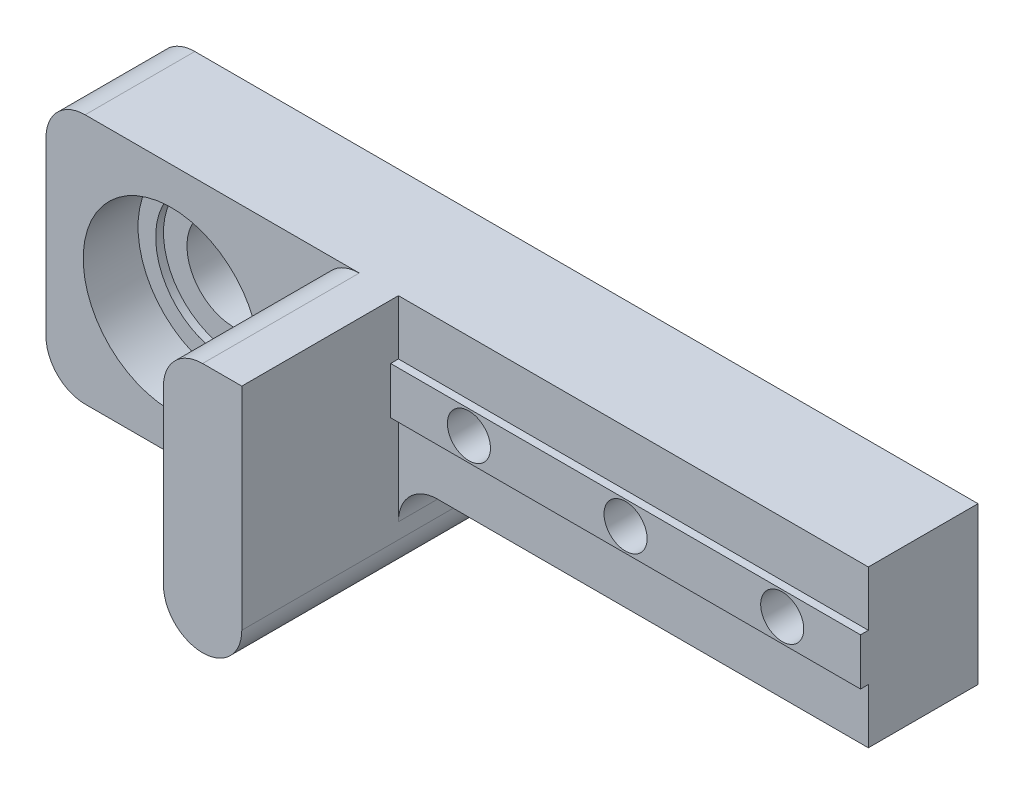
ISO-10303-21;
HEADER;
FILE_DESCRIPTION(('STEP AP214'),'2;1');
FILE_NAME('part.step','',(''),(''),'','','');
FILE_SCHEMA(('AUTOMOTIVE_DESIGN { 1 0 10303 214 1 1 1 1 }'));
ENDSEC;
DATA;
#1=APPLICATION_CONTEXT('core data for automotive mechanical design processes');
#2=APPLICATION_PROTOCOL_DEFINITION('international standard','automotive_design',2000,#1);
#3=PRODUCT_CONTEXT('',#1,'mechanical');
#4=PRODUCT('Part','Part','',(#3));
#5=PRODUCT_RELATED_PRODUCT_CATEGORY('part','',(#4));
#6=PRODUCT_DEFINITION_FORMATION('','',#4);
#7=PRODUCT_DEFINITION_CONTEXT('part definition',#1,'design');
#8=PRODUCT_DEFINITION('design','',#6,#7);
#9=PRODUCT_DEFINITION_SHAPE('','',#8);
#10=(LENGTH_UNIT() NAMED_UNIT(*) SI_UNIT(.MILLI.,.METRE.));
#11=(NAMED_UNIT(*) PLANE_ANGLE_UNIT() SI_UNIT($,.RADIAN.));
#12=(NAMED_UNIT(*) SI_UNIT($,.STERADIAN.) SOLID_ANGLE_UNIT());
#13=UNCERTAINTY_MEASURE_WITH_UNIT(LENGTH_MEASURE(1.E-05),#10,'distance_accuracy_value','');
#14=(GEOMETRIC_REPRESENTATION_CONTEXT(3) GLOBAL_UNCERTAINTY_ASSIGNED_CONTEXT((#13)) GLOBAL_UNIT_ASSIGNED_CONTEXT((#10,
#11,#12)) REPRESENTATION_CONTEXT('',''));
#15=CARTESIAN_POINT('',(0.,0.,0.));
#16=DIRECTION('',(0.,0.,1.));
#17=DIRECTION('',(1.,0.,0.));
#18=AXIS2_PLACEMENT_3D('',#15,#16,#17);
#19=CARTESIAN_POINT('',(-30.,-10.,40.));
#20=DIRECTION('',(0.,0.,-1.));
#21=DIRECTION('',(-1.,0.,0.));
#22=AXIS2_PLACEMENT_3D('',#19,#20,#21);
#23=CYLINDRICAL_SURFACE('',#22,2.75);
#24=CARTESIAN_POINT('',(-30.,-10.,15.));
#25=DIRECTION('',(0.,0.,-1.));
#26=DIRECTION('',(-1.,0.,0.));
#27=AXIS2_PLACEMENT_3D('',#24,#25,#26);
#28=CIRCLE('',#27,2.75);
#29=CARTESIAN_POINT('',(-32.75,-10.,15.));
#30=VERTEX_POINT('',#29);
#31=EDGE_CURVE('E330',#30,#30,#28,.T.);
#32=ORIENTED_EDGE('',*,*,#31,.F.);
#33=EDGE_LOOP('',(#32));
#34=FACE_BOUND('',#33,.T.);
#35=CARTESIAN_POINT('',(-30.,-10.,8.));
#36=DIRECTION('',(0.,0.,-1.));
#37=DIRECTION('',(-1.,0.,0.));
#38=AXIS2_PLACEMENT_3D('',#35,#36,#37);
#39=CIRCLE('',#38,2.75);
#40=CARTESIAN_POINT('',(-32.75,-10.,8.));
#41=VERTEX_POINT('',#40);
#42=EDGE_CURVE('E43',#41,#41,#39,.F.);
#43=ORIENTED_EDGE('',*,*,#42,.F.);
#44=EDGE_LOOP('',(#43));
#45=FACE_BOUND('',#44,.T.);
#46=ADVANCED_FACE('F39',(#34,#45),#23,.F.);
#47=CARTESIAN_POINT('',(-10.,-10.,40.));
#48=DIRECTION('',(0.,0.,-1.));
#49=DIRECTION('',(-1.,0.,0.));
#50=AXIS2_PLACEMENT_3D('',#47,#48,#49);
#51=CYLINDRICAL_SURFACE('',#50,2.75);
#52=CARTESIAN_POINT('',(-10.,-10.,15.));
#53=DIRECTION('',(0.,0.,-1.));
#54=DIRECTION('',(-1.,0.,0.));
#55=AXIS2_PLACEMENT_3D('',#52,#53,#54);
#56=CIRCLE('',#55,2.75);
#57=CARTESIAN_POINT('',(-12.75,-10.,15.));
#58=VERTEX_POINT('',#57);
#59=EDGE_CURVE('E333',#58,#58,#56,.T.);
#60=ORIENTED_EDGE('',*,*,#59,.F.);
#61=EDGE_LOOP('',(#60));
#62=FACE_BOUND('',#61,.T.);
#63=CARTESIAN_POINT('',(-10.,-10.,8.));
#64=DIRECTION('',(0.,0.,-1.));
#65=DIRECTION('',(-1.,0.,0.));
#66=AXIS2_PLACEMENT_3D('',#63,#64,#65);
#67=CIRCLE('',#66,2.75);
#68=CARTESIAN_POINT('',(-12.75,-10.,8.));
#69=VERTEX_POINT('',#68);
#70=EDGE_CURVE('E340',#69,#69,#67,.F.);
#71=ORIENTED_EDGE('',*,*,#70,.F.);
#72=EDGE_LOOP('',(#71));
#73=FACE_BOUND('',#72,.T.);
#74=ADVANCED_FACE('F351',(#62,#73),#51,.F.);
#75=CARTESIAN_POINT('',(-50.,-10.,40.));
#76=DIRECTION('',(0.,0.,-1.));
#77=DIRECTION('',(-1.,0.,0.));
#78=AXIS2_PLACEMENT_3D('',#75,#76,#77);
#79=CYLINDRICAL_SURFACE('',#78,2.75);
#80=CARTESIAN_POINT('',(-50.,-10.,15.));
#81=DIRECTION('',(0.,0.,-1.));
#82=DIRECTION('',(-1.,0.,0.));
#83=AXIS2_PLACEMENT_3D('',#80,#81,#82);
#84=CIRCLE('',#83,2.75);
#85=CARTESIAN_POINT('',(-52.75,-10.,15.));
#86=VERTEX_POINT('',#85);
#87=EDGE_CURVE('E200',#86,#86,#84,.T.);
#88=ORIENTED_EDGE('',*,*,#87,.F.);
#89=EDGE_LOOP('',(#88));
#90=FACE_BOUND('',#89,.T.);
#91=CARTESIAN_POINT('',(-50.,-10.,8.));
#92=DIRECTION('',(0.,0.,-1.));
#93=DIRECTION('',(-1.,0.,0.));
#94=AXIS2_PLACEMENT_3D('',#91,#92,#93);
#95=CIRCLE('',#94,2.75);
#96=CARTESIAN_POINT('',(-52.75,-10.,8.));
#97=VERTEX_POINT('',#96);
#98=EDGE_CURVE('E338',#97,#97,#95,.F.);
#99=ORIENTED_EDGE('',*,*,#98,.F.);
#100=EDGE_LOOP('',(#99));
#101=FACE_BOUND('',#100,.T.);
#102=ADVANCED_FACE('F358',(#90,#101),#79,.F.);
#103=CARTESIAN_POINT('',(0.,0.,14.));
#104=DIRECTION('',(0.,0.,1.));
#105=DIRECTION('',(1.,0.,0.));
#106=AXIS2_PLACEMENT_3D('',#103,#104,#105);
#107=PLANE('',#106);
#108=DIRECTION('',(1.,0.,0.));
#109=VECTOR('',#108,1.);
#110=CARTESIAN_POINT('',(-60.,-7.,14.));
#111=LINE('',#110,#109);
#112=CARTESIAN_POINT('',(-60.,-7.,14.));
#113=VERTEX_POINT('',#112);
#114=CARTESIAN_POINT('',(0.,-7.,14.));
#115=VERTEX_POINT('',#114);
#116=EDGE_CURVE('E191',#113,#115,#111,.T.);
#117=ORIENTED_EDGE('',*,*,#116,.T.);
#118=DIRECTION('',(0.,1.,0.));
#119=VECTOR('',#118,1.);
#120=CARTESIAN_POINT('',(0.,-20.,14.));
#121=LINE('',#120,#119);
#122=CARTESIAN_POINT('',(0.,0.,14.));
#123=VERTEX_POINT('',#122);
#124=EDGE_CURVE('E247',#115,#123,#121,.T.);
#125=ORIENTED_EDGE('',*,*,#124,.T.);
#126=DIRECTION('',(-1.,0.,0.));
#127=VECTOR('',#126,1.);
#128=CARTESIAN_POINT('',(0.,0.,14.));
#129=LINE('',#128,#127);
#130=CARTESIAN_POINT('',(-60.,0.,14.));
#131=VERTEX_POINT('',#130);
#132=EDGE_CURVE('E248',#123,#131,#129,.T.);
#133=ORIENTED_EDGE('',*,*,#132,.T.);
#134=DIRECTION('',(0.,1.,0.));
#135=VECTOR('',#134,1.);
#136=CARTESIAN_POINT('',(-60.,-32.,14.));
#137=LINE('',#136,#135);
#138=EDGE_CURVE('E220',#113,#131,#137,.T.);
#139=ORIENTED_EDGE('',*,*,#138,.F.);
#140=EDGE_LOOP('',(#117,#125,#133,#139));
#141=FACE_BOUND('',#140,.T.);
#142=ADVANCED_FACE('F408',(#141),#107,.T.);
#143=DIRECTION('',(0.,-1.,0.));
#144=VECTOR('',#143,1.);
#145=CARTESIAN_POINT('',(-105.,0.,14.));
#146=LINE('',#145,#144);
#147=CARTESIAN_POINT('',(-105.,-5.00000000000001,14.));
#148=VERTEX_POINT('',#147);
#149=CARTESIAN_POINT('',(-105.,-27.,14.));
#150=VERTEX_POINT('',#149);
#151=EDGE_CURVE('E251',#148,#150,#146,.T.);
#152=ORIENTED_EDGE('',*,*,#151,.T.);
#153=CARTESIAN_POINT('',(-100.,-27.,14.));
#154=DIRECTION('',(0.,0.,1.));
#155=DIRECTION('',(1.,0.,0.));
#156=AXIS2_PLACEMENT_3D('',#153,#154,#155);
#157=CIRCLE('',#156,5.);
#158=CARTESIAN_POINT('',(-100.,-32.,14.));
#159=VERTEX_POINT('',#158);
#160=EDGE_CURVE('E312',#150,#159,#157,.T.);
#161=ORIENTED_EDGE('',*,*,#160,.T.);
#162=DIRECTION('',(1.,0.,0.));
#163=VECTOR('',#162,1.);
#164=CARTESIAN_POINT('',(-105.,-32.,14.));
#165=LINE('',#164,#163);
#166=CARTESIAN_POINT('',(-65.,-32.,14.));
#167=VERTEX_POINT('',#166);
#168=EDGE_CURVE('E254',#159,#167,#165,.T.);
#169=ORIENTED_EDGE('',*,*,#168,.T.);
#170=CARTESIAN_POINT('',(-65.,-27.,14.));
#171=DIRECTION('',(0.,0.,1.));
#172=DIRECTION('',(1.,0.,0.));
#173=AXIS2_PLACEMENT_3D('',#170,#171,#172);
#174=CIRCLE('',#173,5.);
#175=CARTESIAN_POINT('',(-70.,-27.,14.));
#176=VERTEX_POINT('',#175);
#177=EDGE_CURVE('E48',#167,#176,#174,.F.);
#178=ORIENTED_EDGE('',*,*,#177,.T.);
#179=DIRECTION('',(0.,-1.,0.));
#180=VECTOR('',#179,1.);
#181=CARTESIAN_POINT('',(-70.,0.,14.));
#182=LINE('',#181,#180);
#183=CARTESIAN_POINT('',(-70.,-5.00000000000001,14.));
#184=VERTEX_POINT('',#183);
#185=EDGE_CURVE('E210',#184,#176,#182,.T.);
#186=ORIENTED_EDGE('',*,*,#185,.F.);
#187=CARTESIAN_POINT('',(-65.,-5.00000000000001,14.));
#188=DIRECTION('',(0.,0.,1.));
#189=DIRECTION('',(1.,0.,0.));
#190=AXIS2_PLACEMENT_3D('',#187,#188,#189);
#191=CIRCLE('',#190,5.);
#192=CARTESIAN_POINT('',(-65.,0.,14.));
#193=VERTEX_POINT('',#192);
#194=EDGE_CURVE('E11',#184,#193,#191,.F.);
#195=ORIENTED_EDGE('',*,*,#194,.T.);
#196=CARTESIAN_POINT('',(-100.,0.,14.));
#197=VERTEX_POINT('',#196);
#198=EDGE_CURVE('E246',#193,#197,#129,.T.);
#199=ORIENTED_EDGE('',*,*,#198,.T.);
#200=CARTESIAN_POINT('',(-100.,-5.00000000000001,14.));
#201=DIRECTION('',(0.,0.,1.));
#202=DIRECTION('',(1.,0.,0.));
#203=AXIS2_PLACEMENT_3D('',#200,#201,#202);
#204=CIRCLE('',#203,5.);
#205=EDGE_CURVE('E310',#197,#148,#204,.T.);
#206=ORIENTED_EDGE('',*,*,#205,.T.);
#207=EDGE_LOOP('',(#152,#161,#169,#178,#186,#195,#199,#206));
#208=FACE_BOUND('',#207,.T.);
#209=CARTESIAN_POINT('',(-89.,-16.,14.));
#210=DIRECTION('',(0.,0.,1.));
#211=DIRECTION('',(1.,0.,0.));
#212=AXIS2_PLACEMENT_3D('',#209,#210,#211);
#213=CIRCLE('',#212,11.25);
#214=CARTESIAN_POINT('',(-77.75,-16.,14.));
#215=VERTEX_POINT('',#214);
#216=EDGE_CURVE('E235',#215,#215,#213,.T.);
#217=ORIENTED_EDGE('',*,*,#216,.F.);
#218=EDGE_LOOP('',(#217));
#219=FACE_BOUND('',#218,.T.);
#220=ADVANCED_FACE('F409',(#208,#219),#107,.T.);
#221=CARTESIAN_POINT('',(0.,-20.,14.));
#222=DIRECTION('',(-1.,0.,0.));
#223=DIRECTION('',(0.,0.,1.));
#224=AXIS2_PLACEMENT_3D('',#221,#222,#223);
#225=PLANE('',#224);
#226=DIRECTION('',(0.,1.,0.));
#227=VECTOR('',#226,1.);
#228=CARTESIAN_POINT('',(0.,-20.,0.));
#229=LINE('',#228,#227);
#230=CARTESIAN_POINT('',(0.,-20.,0.));
#231=VERTEX_POINT('',#230);
#232=CARTESIAN_POINT('',(0.,0.,0.));
#233=VERTEX_POINT('',#232);
#234=EDGE_CURVE('E241',#231,#233,#229,.T.);
#235=ORIENTED_EDGE('',*,*,#234,.T.);
#236=DIRECTION('',(0.,0.,-1.));
#237=VECTOR('',#236,1.);
#238=CARTESIAN_POINT('',(0.,0.,14.));
#239=LINE('',#238,#237);
#240=EDGE_CURVE('E276',#123,#233,#239,.T.);
#241=ORIENTED_EDGE('',*,*,#240,.F.);
#242=ORIENTED_EDGE('',*,*,#124,.F.);
#243=DIRECTION('',(0.,0.,-1.));
#244=VECTOR('',#243,1.);
#245=CARTESIAN_POINT('',(0.,-7.,15.));
#246=LINE('',#245,#244);
#247=CARTESIAN_POINT('',(0.,-7.,15.));
#248=VERTEX_POINT('',#247);
#249=EDGE_CURVE('E190',#248,#115,#246,.T.);
#250=ORIENTED_EDGE('',*,*,#249,.F.);
#251=DIRECTION('',(0.,-1.,0.));
#252=VECTOR('',#251,1.);
#253=CARTESIAN_POINT('',(0.,-7.,15.));
#254=LINE('',#253,#252);
#255=CARTESIAN_POINT('',(0.,-13.,15.));
#256=VERTEX_POINT('',#255);
#257=EDGE_CURVE('E183',#248,#256,#254,.T.);
#258=ORIENTED_EDGE('',*,*,#257,.T.);
#259=DIRECTION('',(0.,0.,-1.));
#260=VECTOR('',#259,1.);
#261=CARTESIAN_POINT('',(0.,-13.,15.));
#262=LINE('',#261,#260);
#263=CARTESIAN_POINT('',(0.,-13.,14.));
#264=VERTEX_POINT('',#263);
#265=EDGE_CURVE('E169',#256,#264,#262,.T.);
#266=ORIENTED_EDGE('',*,*,#265,.T.);
#267=CARTESIAN_POINT('',(0.,-20.,14.));
#268=VERTEX_POINT('',#267);
#269=EDGE_CURVE('E244',#268,#264,#121,.T.);
#270=ORIENTED_EDGE('',*,*,#269,.F.);
#271=DIRECTION('',(0.,0.,-1.));
#272=VECTOR('',#271,1.);
#273=CARTESIAN_POINT('',(0.,-20.,14.));
#274=LINE('',#273,#272);
#275=EDGE_CURVE('E258',#268,#231,#274,.T.);
#276=ORIENTED_EDGE('',*,*,#275,.T.);
#277=EDGE_LOOP('',(#235,#241,#242,#250,#258,#266,#270,#276));
#278=FACE_BOUND('',#277,.T.);
#279=ADVANCED_FACE('F187',(#278),#225,.F.);
#280=CARTESIAN_POINT('',(0.,0.,14.));
#281=DIRECTION('',(0.,-1.,0.));
#282=DIRECTION('',(1.,0.,0.));
#283=AXIS2_PLACEMENT_3D('',#280,#281,#282);
#284=PLANE('',#283);
#285=DIRECTION('',(-1.,0.,0.));
#286=VECTOR('',#285,1.);
#287=CARTESIAN_POINT('',(0.,0.,0.));
#288=LINE('',#287,#286);
#289=CARTESIAN_POINT('',(-100.,0.,0.));
#290=VERTEX_POINT('',#289);
#291=EDGE_CURVE('E260',#233,#290,#288,.T.);
#292=ORIENTED_EDGE('',*,*,#291,.T.);
#293=DIRECTION('',(0.,0.,-1.));
#294=VECTOR('',#293,1.);
#295=CARTESIAN_POINT('',(-100.,0.,14.));
#296=LINE('',#295,#294);
#297=EDGE_CURVE('E316',#290,#197,#296,.F.);
#298=ORIENTED_EDGE('',*,*,#297,.T.);
#299=ORIENTED_EDGE('',*,*,#198,.F.);
#300=DIRECTION('',(0.,0.,-1.));
#301=VECTOR('',#300,1.);
#302=CARTESIAN_POINT('',(-65.,0.,14.));
#303=LINE('',#302,#301);
#304=CARTESIAN_POINT('',(-65.,0.,34.));
#305=VERTEX_POINT('',#304);
#306=EDGE_CURVE('E314',#193,#305,#303,.F.);
#307=ORIENTED_EDGE('',*,*,#306,.T.);
#308=DIRECTION('',(-1.,0.,0.));
#309=VECTOR('',#308,1.);
#310=CARTESIAN_POINT('',(-60.,0.,34.));
#311=LINE('',#310,#309);
#312=CARTESIAN_POINT('',(-60.,0.,34.));
#313=VERTEX_POINT('',#312);
#314=EDGE_CURVE('E209',#313,#305,#311,.T.);
#315=ORIENTED_EDGE('',*,*,#314,.F.);
#316=DIRECTION('',(0.,0.,-1.));
#317=VECTOR('',#316,1.);
#318=CARTESIAN_POINT('',(-60.,0.,34.));
#319=LINE('',#318,#317);
#320=EDGE_CURVE('E216',#313,#131,#319,.T.);
#321=ORIENTED_EDGE('',*,*,#320,.T.);
#322=ORIENTED_EDGE('',*,*,#132,.F.);
#323=ORIENTED_EDGE('',*,*,#240,.T.);
#324=EDGE_LOOP('',(#292,#298,#299,#307,#315,#321,#322,#323));
#325=FACE_BOUND('',#324,.T.);
#326=ADVANCED_FACE('F426',(#325),#284,.F.);
#327=CARTESIAN_POINT('',(-105.,0.,14.));
#328=DIRECTION('',(1.,0.,0.));
#329=DIRECTION('',(0.,1.,0.));
#330=AXIS2_PLACEMENT_3D('',#327,#328,#329);
#331=PLANE('',#330);
#332=DIRECTION('',(0.,-1.,0.));
#333=VECTOR('',#332,1.);
#334=CARTESIAN_POINT('',(-105.,0.,0.));
#335=LINE('',#334,#333);
#336=CARTESIAN_POINT('',(-105.,-5.00000000000001,0.));
#337=VERTEX_POINT('',#336);
#338=CARTESIAN_POINT('',(-105.,-27.,0.));
#339=VERTEX_POINT('',#338);
#340=EDGE_CURVE('E263',#337,#339,#335,.T.);
#341=ORIENTED_EDGE('',*,*,#340,.T.);
#342=DIRECTION('',(0.,0.,-1.));
#343=VECTOR('',#342,1.);
#344=CARTESIAN_POINT('',(-105.,-27.,14.));
#345=LINE('',#344,#343);
#346=EDGE_CURVE('E308',#339,#150,#345,.F.);
#347=ORIENTED_EDGE('',*,*,#346,.T.);
#348=ORIENTED_EDGE('',*,*,#151,.F.);
#349=DIRECTION('',(0.,0.,-1.));
#350=VECTOR('',#349,1.);
#351=CARTESIAN_POINT('',(-105.,-5.00000000000001,14.));
#352=LINE('',#351,#350);
#353=EDGE_CURVE('E305',#148,#337,#352,.T.);
#354=ORIENTED_EDGE('',*,*,#353,.T.);
#355=EDGE_LOOP('',(#341,#347,#348,#354));
#356=FACE_BOUND('',#355,.T.);
#357=ADVANCED_FACE('F422',(#356),#331,.F.);
#358=CARTESIAN_POINT('',(-105.,-32.,14.));
#359=DIRECTION('',(0.,1.,0.));
#360=DIRECTION('',(-1.,0.,0.));
#361=AXIS2_PLACEMENT_3D('',#358,#359,#360);
#362=PLANE('',#361);
#363=ORIENTED_EDGE('',*,*,#168,.F.);
#364=DIRECTION('',(0.,0.,-1.));
#365=VECTOR('',#364,1.);
#366=CARTESIAN_POINT('',(-100.,-32.,14.));
#367=LINE('',#366,#365);
#368=CARTESIAN_POINT('',(-100.,-32.,0.));
#369=VERTEX_POINT('',#368);
#370=EDGE_CURVE('E293',#159,#369,#367,.T.);
#371=ORIENTED_EDGE('',*,*,#370,.T.);
#372=DIRECTION('',(1.,0.,0.));
#373=VECTOR('',#372,1.);
#374=CARTESIAN_POINT('',(-105.,-32.,0.));
#375=LINE('',#374,#373);
#376=CARTESIAN_POINT('',(-65.,-32.,0.));
#377=VERTEX_POINT('',#376);
#378=EDGE_CURVE('E266',#369,#377,#375,.T.);
#379=ORIENTED_EDGE('',*,*,#378,.T.);
#380=DIRECTION('',(0.,0.,-1.));
#381=VECTOR('',#380,1.);
#382=CARTESIAN_POINT('',(-65.,-32.,14.));
#383=LINE('',#382,#381);
#384=EDGE_CURVE('E290',#377,#167,#383,.F.);
#385=ORIENTED_EDGE('',*,*,#384,.T.);
#386=EDGE_LOOP('',(#363,#371,#379,#385));
#387=FACE_BOUND('',#386,.T.);
#388=ADVANCED_FACE('F419',(#387),#362,.F.);
#389=CARTESIAN_POINT('',(-60.,-32.,14.));
#390=DIRECTION('',(-1.,0.,0.));
#391=DIRECTION('',(0.,0.,1.));
#392=AXIS2_PLACEMENT_3D('',#389,#390,#391);
#393=PLANE('',#392);
#394=DIRECTION('',(0.,1.,0.));
#395=VECTOR('',#394,1.);
#396=CARTESIAN_POINT('',(-60.,-13.,15.));
#397=LINE('',#396,#395);
#398=CARTESIAN_POINT('',(-60.,-13.,15.));
#399=VERTEX_POINT('',#398);
#400=CARTESIAN_POINT('',(-60.,-7.,15.));
#401=VERTEX_POINT('',#400);
#402=EDGE_CURVE('E60',#399,#401,#397,.T.);
#403=ORIENTED_EDGE('',*,*,#402,.T.);
#404=DIRECTION('',(0.,0.,-1.));
#405=VECTOR('',#404,1.);
#406=CARTESIAN_POINT('',(-60.,-7.,15.));
#407=LINE('',#406,#405);
#408=EDGE_CURVE('E204',#401,#113,#407,.T.);
#409=ORIENTED_EDGE('',*,*,#408,.T.);
#410=ORIENTED_EDGE('',*,*,#138,.T.);
#411=ORIENTED_EDGE('',*,*,#320,.F.);
#412=DIRECTION('',(0.,1.,0.));
#413=VECTOR('',#412,1.);
#414=CARTESIAN_POINT('',(-60.,-32.,34.));
#415=LINE('',#414,#413);
#416=CARTESIAN_POINT('',(-60.,-27.,34.));
#417=VERTEX_POINT('',#416);
#418=EDGE_CURVE('E207',#417,#313,#415,.T.);
#419=ORIENTED_EDGE('',*,*,#418,.F.);
#420=DIRECTION('',(0.,0.,-1.));
#421=VECTOR('',#420,1.);
#422=CARTESIAN_POINT('',(-60.,-27.,14.));
#423=LINE('',#422,#421);
#424=CARTESIAN_POINT('',(-60.,-27.,0.));
#425=VERTEX_POINT('',#424);
#426=EDGE_CURVE('E281',#417,#425,#423,.T.);
#427=ORIENTED_EDGE('',*,*,#426,.T.);
#428=DIRECTION('',(0.,1.,0.));
#429=VECTOR('',#428,1.);
#430=CARTESIAN_POINT('',(-60.,-32.,0.));
#431=LINE('',#430,#429);
#432=CARTESIAN_POINT('',(-60.,-25.,0.));
#433=VERTEX_POINT('',#432);
#434=EDGE_CURVE('E269',#425,#433,#431,.T.);
#435=ORIENTED_EDGE('',*,*,#434,.T.);
#436=DIRECTION('',(0.,0.,-1.));
#437=VECTOR('',#436,1.);
#438=CARTESIAN_POINT('',(-60.,-25.,14.));
#439=LINE('',#438,#437);
#440=CARTESIAN_POINT('',(-60.,-25.,14.));
#441=VERTEX_POINT('',#440);
#442=EDGE_CURVE('E219',#433,#441,#439,.F.);
#443=ORIENTED_EDGE('',*,*,#442,.T.);
#444=CARTESIAN_POINT('',(-60.,-13.,14.));
#445=VERTEX_POINT('',#444);
#446=EDGE_CURVE('E217',#441,#445,#137,.T.);
#447=ORIENTED_EDGE('',*,*,#446,.T.);
#448=DIRECTION('',(0.,0.,-1.));
#449=VECTOR('',#448,1.);
#450=CARTESIAN_POINT('',(-60.,-13.,15.));
#451=LINE('',#450,#449);
#452=EDGE_CURVE('E56',#399,#445,#451,.T.);
#453=ORIENTED_EDGE('',*,*,#452,.F.);
#454=EDGE_LOOP('',(#403,#409,#410,#411,#419,#427,#435,#443,#447,#453));
#455=FACE_BOUND('',#454,.T.);
#456=ADVANCED_FACE('F415',(#455),#393,.F.);
#457=CARTESIAN_POINT('',(-60.,-20.,14.));
#458=DIRECTION('',(0.,1.,0.));
#459=DIRECTION('',(0.,0.,1.));
#460=AXIS2_PLACEMENT_3D('',#457,#458,#459);
#461=PLANE('',#460);
#462=DIRECTION('',(1.,0.,0.));
#463=VECTOR('',#462,1.);
#464=CARTESIAN_POINT('',(-60.,-20.,14.));
#465=LINE('',#464,#463);
#466=CARTESIAN_POINT('',(-55.,-20.,14.));
#467=VERTEX_POINT('',#466);
#468=EDGE_CURVE('E256',#467,#268,#465,.T.);
#469=ORIENTED_EDGE('',*,*,#468,.F.);
#470=DIRECTION('',(0.,0.,-1.));
#471=VECTOR('',#470,1.);
#472=CARTESIAN_POINT('',(-55.,-20.,0.));
#473=LINE('',#472,#471);
#474=CARTESIAN_POINT('',(-55.,-20.,0.));
#475=VERTEX_POINT('',#474);
#476=EDGE_CURVE('E302',#467,#475,#473,.T.);
#477=ORIENTED_EDGE('',*,*,#476,.T.);
#478=DIRECTION('',(1.,0.,0.));
#479=VECTOR('',#478,1.);
#480=CARTESIAN_POINT('',(-60.,-20.,0.));
#481=LINE('',#480,#479);
#482=EDGE_CURVE('E272',#475,#231,#481,.T.);
#483=ORIENTED_EDGE('',*,*,#482,.T.);
#484=ORIENTED_EDGE('',*,*,#275,.F.);
#485=EDGE_LOOP('',(#469,#477,#483,#484));
#486=FACE_BOUND('',#485,.T.);
#487=ADVANCED_FACE('F406',(#486),#461,.F.);
#488=DIRECTION('',(-1.,0.,0.));
#489=VECTOR('',#488,1.);
#490=CARTESIAN_POINT('',(0.,-13.,14.));
#491=LINE('',#490,#489);
#492=EDGE_CURVE('E173',#264,#445,#491,.T.);
#493=ORIENTED_EDGE('',*,*,#492,.T.);
#494=ORIENTED_EDGE('',*,*,#446,.F.);
#495=CARTESIAN_POINT('',(-55.,-25.,14.));
#496=DIRECTION('',(0.,0.,1.));
#497=DIRECTION('',(1.,0.,0.));
#498=AXIS2_PLACEMENT_3D('',#495,#496,#497);
#499=CIRCLE('',#498,5.);
#500=EDGE_CURVE('E325',#441,#467,#499,.F.);
#501=ORIENTED_EDGE('',*,*,#500,.T.);
#502=ORIENTED_EDGE('',*,*,#468,.T.);
#503=ORIENTED_EDGE('',*,*,#269,.T.);
#504=EDGE_LOOP('',(#493,#494,#501,#502,#503));
#505=FACE_BOUND('',#504,.T.);
#506=ADVANCED_FACE('F403',(#505),#107,.T.);
#507=CARTESIAN_POINT('',(0.,0.,0.));
#508=DIRECTION('',(0.,0.,1.));
#509=DIRECTION('',(1.,0.,0.));
#510=AXIS2_PLACEMENT_3D('',#507,#508,#509);
#511=PLANE('',#510);
#512=CARTESIAN_POINT('',(-10.,-10.,0.));
#513=DIRECTION('',(0.,0.,-1.));
#514=DIRECTION('',(-1.,0.,0.));
#515=AXIS2_PLACEMENT_3D('',#512,#513,#514);
#516=CIRCLE('',#515,6.);
#517=CARTESIAN_POINT('',(-16.,-10.,0.));
#518=VERTEX_POINT('',#517);
#519=EDGE_CURVE('E537',#518,#518,#516,.T.);
#520=ORIENTED_EDGE('',*,*,#519,.F.);
#521=EDGE_LOOP('',(#520));
#522=FACE_BOUND('',#521,.T.);
#523=CARTESIAN_POINT('',(-30.,-10.,0.));
#524=DIRECTION('',(0.,0.,-1.));
#525=DIRECTION('',(-1.,0.,0.));
#526=AXIS2_PLACEMENT_3D('',#523,#524,#525);
#527=CIRCLE('',#526,6.);
#528=CARTESIAN_POINT('',(-36.,-10.,0.));
#529=VERTEX_POINT('',#528);
#530=EDGE_CURVE('E540',#529,#529,#527,.T.);
#531=ORIENTED_EDGE('',*,*,#530,.F.);
#532=EDGE_LOOP('',(#531));
#533=FACE_BOUND('',#532,.T.);
#534=CARTESIAN_POINT('',(-50.,-10.,0.));
#535=DIRECTION('',(0.,0.,-1.));
#536=DIRECTION('',(-1.,0.,0.));
#537=AXIS2_PLACEMENT_3D('',#534,#535,#536);
#538=CIRCLE('',#537,6.);
#539=CARTESIAN_POINT('',(-56.,-10.,0.));
#540=VERTEX_POINT('',#539);
#541=EDGE_CURVE('E547',#540,#540,#538,.T.);
#542=ORIENTED_EDGE('',*,*,#541,.F.);
#543=EDGE_LOOP('',(#542));
#544=FACE_BOUND('',#543,.T.);
#545=CARTESIAN_POINT('',(-89.,-16.,0.));
#546=DIRECTION('',(0.,0.,1.));
#547=DIRECTION('',(1.,0.,0.));
#548=AXIS2_PLACEMENT_3D('',#545,#546,#547);
#549=CIRCLE('',#548,6.);
#550=CARTESIAN_POINT('',(-83.,-16.,0.));
#551=VERTEX_POINT('',#550);
#552=EDGE_CURVE('E228',#551,#551,#549,.F.);
#553=ORIENTED_EDGE('',*,*,#552,.F.);
#554=EDGE_LOOP('',(#553));
#555=FACE_BOUND('',#554,.T.);
#556=ORIENTED_EDGE('',*,*,#434,.F.);
#557=CARTESIAN_POINT('',(-65.,-27.,0.));
#558=DIRECTION('',(0.,0.,1.));
#559=DIRECTION('',(1.,0.,0.));
#560=AXIS2_PLACEMENT_3D('',#557,#558,#559);
#561=CIRCLE('',#560,5.);
#562=EDGE_CURVE('E288',#425,#377,#561,.F.);
#563=ORIENTED_EDGE('',*,*,#562,.T.);
#564=ORIENTED_EDGE('',*,*,#378,.F.);
#565=CARTESIAN_POINT('',(-100.,-27.,0.));
#566=DIRECTION('',(0.,0.,1.));
#567=DIRECTION('',(1.,0.,0.));
#568=AXIS2_PLACEMENT_3D('',#565,#566,#567);
#569=CIRCLE('',#568,5.);
#570=EDGE_CURVE('E286',#369,#339,#569,.F.);
#571=ORIENTED_EDGE('',*,*,#570,.T.);
#572=ORIENTED_EDGE('',*,*,#340,.F.);
#573=CARTESIAN_POINT('',(-100.,-5.00000000000001,0.));
#574=DIRECTION('',(0.,0.,1.));
#575=DIRECTION('',(1.,0.,0.));
#576=AXIS2_PLACEMENT_3D('',#573,#574,#575);
#577=CIRCLE('',#576,5.);
#578=EDGE_CURVE('E284',#337,#290,#577,.F.);
#579=ORIENTED_EDGE('',*,*,#578,.T.);
#580=ORIENTED_EDGE('',*,*,#291,.F.);
#581=ORIENTED_EDGE('',*,*,#234,.F.);
#582=ORIENTED_EDGE('',*,*,#482,.F.);
#583=CARTESIAN_POINT('',(-55.,-25.,0.));
#584=DIRECTION('',(0.,0.,1.));
#585=DIRECTION('',(1.,0.,0.));
#586=AXIS2_PLACEMENT_3D('',#583,#584,#585);
#587=CIRCLE('',#586,5.);
#588=EDGE_CURVE('E323',#475,#433,#587,.T.);
#589=ORIENTED_EDGE('',*,*,#588,.T.);
#590=EDGE_LOOP('',(#556,#563,#564,#571,#572,#579,#580,#581,#582,#589));
#591=FACE_BOUND('',#590,.T.);
#592=ADVANCED_FACE('F401',(#522,#533,#544,#555,#591),#511,.F.);
#593=CARTESIAN_POINT('',(-89.,-16.,7.));
#594=DIRECTION('',(0.,0.,1.));
#595=DIRECTION('',(1.,0.,0.));
#596=AXIS2_PLACEMENT_3D('',#593,#594,#595);
#597=CYLINDRICAL_SURFACE('',#596,11.25);
#598=CARTESIAN_POINT('',(-89.,-16.,7.));
#599=DIRECTION('',(0.,0.,1.));
#600=DIRECTION('',(1.,0.,0.));
#601=AXIS2_PLACEMENT_3D('',#598,#599,#600);
#602=CIRCLE('',#601,11.25);
#603=CARTESIAN_POINT('',(-77.75,-16.,7.));
#604=VERTEX_POINT('',#603);
#605=EDGE_CURVE('E238',#604,#604,#602,.T.);
#606=ORIENTED_EDGE('',*,*,#605,.F.);
#607=EDGE_LOOP('',(#606));
#608=FACE_BOUND('',#607,.T.);
#609=ORIENTED_EDGE('',*,*,#216,.T.);
#610=EDGE_LOOP('',(#609));
#611=FACE_BOUND('',#610,.T.);
#612=ADVANCED_FACE('F397',(#608,#611),#597,.F.);
#613=CARTESIAN_POINT('',(-89.,-16.,7.));
#614=DIRECTION('',(0.,0.,1.));
#615=DIRECTION('',(1.,0.,0.));
#616=AXIS2_PLACEMENT_3D('',#613,#614,#615);
#617=PLANE('',#616);
#618=CARTESIAN_POINT('',(-89.,-16.,7.));
#619=DIRECTION('',(0.,0.,1.));
#620=DIRECTION('',(1.,0.,0.));
#621=AXIS2_PLACEMENT_3D('',#618,#619,#620);
#622=CIRCLE('',#621,9.00000000000001);
#623=CARTESIAN_POINT('',(-80.,-16.,7.));
#624=VERTEX_POINT('',#623);
#625=EDGE_CURVE('E231',#624,#624,#622,.T.);
#626=ORIENTED_EDGE('',*,*,#625,.F.);
#627=EDGE_LOOP('',(#626));
#628=FACE_BOUND('',#627,.T.);
#629=ORIENTED_EDGE('',*,*,#605,.T.);
#630=EDGE_LOOP('',(#629));
#631=FACE_BOUND('',#630,.T.);
#632=ADVANCED_FACE('F393',(#628,#631),#617,.T.);
#633=CARTESIAN_POINT('',(-89.,-16.,6.));
#634=DIRECTION('',(0.,0.,1.));
#635=DIRECTION('',(1.,0.,0.));
#636=AXIS2_PLACEMENT_3D('',#633,#634,#635);
#637=CYLINDRICAL_SURFACE('',#636,9.00000000000001);
#638=CARTESIAN_POINT('',(-89.,-16.,6.));
#639=DIRECTION('',(0.,0.,1.));
#640=DIRECTION('',(1.,0.,0.));
#641=AXIS2_PLACEMENT_3D('',#638,#639,#640);
#642=CIRCLE('',#641,9.00000000000001);
#643=CARTESIAN_POINT('',(-80.,-16.,6.));
#644=VERTEX_POINT('',#643);
#645=EDGE_CURVE('E232',#644,#644,#642,.T.);
#646=ORIENTED_EDGE('',*,*,#645,.F.);
#647=EDGE_LOOP('',(#646));
#648=FACE_BOUND('',#647,.T.);
#649=ORIENTED_EDGE('',*,*,#625,.T.);
#650=EDGE_LOOP('',(#649));
#651=FACE_BOUND('',#650,.T.);
#652=ADVANCED_FACE('F389',(#648,#651),#637,.F.);
#653=CARTESIAN_POINT('',(-89.,-16.,6.));
#654=DIRECTION('',(0.,0.,1.));
#655=DIRECTION('',(1.,0.,0.));
#656=AXIS2_PLACEMENT_3D('',#653,#654,#655);
#657=PLANE('',#656);
#658=CARTESIAN_POINT('',(-89.,-16.,6.));
#659=DIRECTION('',(0.,0.,1.));
#660=DIRECTION('',(1.,0.,0.));
#661=AXIS2_PLACEMENT_3D('',#658,#659,#660);
#662=CIRCLE('',#661,6.);
#663=CARTESIAN_POINT('',(-83.,-16.,6.));
#664=VERTEX_POINT('',#663);
#665=EDGE_CURVE('E225',#664,#664,#662,.T.);
#666=ORIENTED_EDGE('',*,*,#665,.F.);
#667=EDGE_LOOP('',(#666));
#668=FACE_BOUND('',#667,.T.);
#669=ORIENTED_EDGE('',*,*,#645,.T.);
#670=EDGE_LOOP('',(#669));
#671=FACE_BOUND('',#670,.T.);
#672=ADVANCED_FACE('F385',(#668,#671),#657,.T.);
#673=CARTESIAN_POINT('',(-89.,-16.,-0.00100000000000013));
#674=DIRECTION('',(0.,0.,1.));
#675=DIRECTION('',(1.,0.,0.));
#676=AXIS2_PLACEMENT_3D('',#673,#674,#675);
#677=CYLINDRICAL_SURFACE('',#676,6.);
#678=CARTESIAN_POINT('',(-83.,-16.,6.));
#679=CARTESIAN_POINT('',(-83.,-16.,5.9375));
#680=CARTESIAN_POINT('',(-83.,-16.,5.875));
#681=CARTESIAN_POINT('',(-83.,-16.,5.75));
#682=CARTESIAN_POINT('',(-83.,-16.,5.6875));
#683=CARTESIAN_POINT('',(-83.,-16.,5.5625));
#684=CARTESIAN_POINT('',(-83.,-16.,5.5));
#685=CARTESIAN_POINT('',(-83.,-16.,5.375));
#686=CARTESIAN_POINT('',(-83.,-16.,5.3125));
#687=CARTESIAN_POINT('',(-83.,-16.,5.1875));
#688=CARTESIAN_POINT('',(-83.,-16.,5.125));
#689=CARTESIAN_POINT('',(-83.,-16.,5.));
#690=CARTESIAN_POINT('',(-83.,-16.,4.9375));
#691=CARTESIAN_POINT('',(-83.,-16.,4.8125));
#692=CARTESIAN_POINT('',(-83.,-16.,4.75));
#693=CARTESIAN_POINT('',(-83.,-16.,4.625));
#694=CARTESIAN_POINT('',(-83.,-16.,4.5625));
#695=CARTESIAN_POINT('',(-83.,-16.,4.4375));
#696=CARTESIAN_POINT('',(-83.,-16.,4.375));
#697=CARTESIAN_POINT('',(-83.,-16.,4.25));
#698=CARTESIAN_POINT('',(-83.,-16.,4.1875));
#699=CARTESIAN_POINT('',(-83.,-16.,4.0625));
#700=CARTESIAN_POINT('',(-83.,-16.,4.));
#701=CARTESIAN_POINT('',(-83.,-16.,3.875));
#702=CARTESIAN_POINT('',(-83.,-16.,3.8125));
#703=CARTESIAN_POINT('',(-83.,-16.,3.6875));
#704=CARTESIAN_POINT('',(-83.,-16.,3.625));
#705=CARTESIAN_POINT('',(-83.,-16.,3.5));
#706=CARTESIAN_POINT('',(-83.,-16.,3.4375));
#707=CARTESIAN_POINT('',(-83.,-16.,3.3125));
#708=CARTESIAN_POINT('',(-83.,-16.,3.25));
#709=CARTESIAN_POINT('',(-83.,-16.,3.125));
#710=CARTESIAN_POINT('',(-83.,-16.,3.0625));
#711=CARTESIAN_POINT('',(-83.,-16.,2.9375));
#712=CARTESIAN_POINT('',(-83.,-16.,2.875));
#713=CARTESIAN_POINT('',(-83.,-16.,2.75));
#714=CARTESIAN_POINT('',(-83.,-16.,2.6875));
#715=CARTESIAN_POINT('',(-83.,-16.,2.5625));
#716=CARTESIAN_POINT('',(-83.,-16.,2.5));
#717=CARTESIAN_POINT('',(-83.,-16.,2.375));
#718=CARTESIAN_POINT('',(-83.,-16.,2.3125));
#719=CARTESIAN_POINT('',(-83.,-16.,2.1875));
#720=CARTESIAN_POINT('',(-83.,-16.,2.125));
#721=CARTESIAN_POINT('',(-83.,-16.,2.));
#722=CARTESIAN_POINT('',(-83.,-16.,1.9375));
#723=CARTESIAN_POINT('',(-83.,-16.,1.8125));
#724=CARTESIAN_POINT('',(-83.,-16.,1.75));
#725=CARTESIAN_POINT('',(-83.,-16.,1.625));
#726=CARTESIAN_POINT('',(-83.,-16.,1.5625));
#727=CARTESIAN_POINT('',(-83.,-16.,1.4375));
#728=CARTESIAN_POINT('',(-83.,-16.,1.375));
#729=CARTESIAN_POINT('',(-83.,-16.,1.25));
#730=CARTESIAN_POINT('',(-83.,-16.,1.1875));
#731=CARTESIAN_POINT('',(-83.,-16.,1.0625));
#732=CARTESIAN_POINT('',(-83.,-16.,1.));
#733=CARTESIAN_POINT('',(-83.,-16.,0.875));
#734=CARTESIAN_POINT('',(-83.,-16.,0.8125));
#735=CARTESIAN_POINT('',(-83.,-16.,0.6875));
#736=CARTESIAN_POINT('',(-83.,-16.,0.625));
#737=CARTESIAN_POINT('',(-83.,-16.,0.5));
#738=CARTESIAN_POINT('',(-83.,-16.,0.4375));
#739=CARTESIAN_POINT('',(-83.,-16.,0.3125));
#740=CARTESIAN_POINT('',(-83.,-16.,0.25));
#741=CARTESIAN_POINT('',(-83.,-16.,0.125));
#742=CARTESIAN_POINT('',(-83.,-16.,0.0625000000000001));
#743=CARTESIAN_POINT('',(-83.,-16.,0.));
#744=B_SPLINE_CURVE_WITH_KNOTS('',3,(#678,#679,#680,#681,#682,#683,#684,#685,#686,#687,#688,
#689,#690,#691,#692,#693,#694,#695,#696,#697,#698,#699,#700,#701,#702,#703,#704,#705,#706,#707,
#708,#709,#710,#711,#712,#713,#714,#715,#716,#717,#718,#719,#720,#721,#722,#723,#724,#725,#726,
#727,#728,#729,#730,#731,#732,#733,#734,#735,#736,#737,#738,#739,#740,#741,#742,#743),
.UNSPECIFIED.,.F.,.F.,(4,2,2,2,2,2,2,2,2,2,2,2,2,2,2,2,2,2,2,2,2,2,2,2,2,2,2,2,2,2,2,2,4),(0.,
0.1875,0.375,0.5625,0.75,0.9375,1.125,1.3125,1.5,1.6875,1.875,2.0625,2.25,2.4375,2.625,2.8125,
3.,3.1875,3.375,3.5625,3.75,3.9375,4.125,4.3125,4.5,4.6875,4.875,5.0625,5.25,5.4375,5.625,
5.8125,6.),.UNSPECIFIED.);
#745=EDGE_CURVE('BSEAM381',#664,#551,#744,.T.);
#746=ORIENTED_EDGE('',*,*,#665,.T.);
#747=ORIENTED_EDGE('',*,*,#552,.T.);
#748=ORIENTED_EDGE('',*,*,#745,.T.);
#749=ORIENTED_EDGE('',*,*,#745,.F.);
#750=EDGE_LOOP('',(#746,#748,#747,#749));
#751=FACE_BOUND('',#750,.T.);
#752=ADVANCED_FACE('F381',(#751),#677,.F.);
#753=CARTESIAN_POINT('',(-70.,0.,34.));
#754=DIRECTION('',(1.,0.,0.));
#755=DIRECTION('',(0.,0.,-1.));
#756=AXIS2_PLACEMENT_3D('',#753,#754,#755);
#757=PLANE('',#756);
#758=ORIENTED_EDGE('',*,*,#185,.T.);
#759=DIRECTION('',(0.,0.,-1.));
#760=VECTOR('',#759,1.);
#761=CARTESIAN_POINT('',(-70.,-27.,34.));
#762=LINE('',#761,#760);
#763=CARTESIAN_POINT('',(-70.,-27.,34.));
#764=VERTEX_POINT('',#763);
#765=EDGE_CURVE('E321',#176,#764,#762,.F.);
#766=ORIENTED_EDGE('',*,*,#765,.T.);
#767=DIRECTION('',(0.,-1.,0.));
#768=VECTOR('',#767,1.);
#769=CARTESIAN_POINT('',(-70.,0.,34.));
#770=LINE('',#769,#768);
#771=CARTESIAN_POINT('',(-70.,-5.00000000000001,34.));
#772=VERTEX_POINT('',#771);
#773=EDGE_CURVE('E213',#772,#764,#770,.T.);
#774=ORIENTED_EDGE('',*,*,#773,.F.);
#775=DIRECTION('',(0.,0.,-1.));
#776=VECTOR('',#775,1.);
#777=CARTESIAN_POINT('',(-70.,-5.00000000000001,34.));
#778=LINE('',#777,#776);
#779=EDGE_CURVE('E318',#772,#184,#778,.T.);
#780=ORIENTED_EDGE('',*,*,#779,.T.);
#781=EDGE_LOOP('',(#758,#766,#774,#780));
#782=FACE_BOUND('',#781,.T.);
#783=ADVANCED_FACE('F377',(#782),#757,.F.);
#784=CARTESIAN_POINT('',(0.,0.,34.));
#785=DIRECTION('',(0.,0.,1.));
#786=DIRECTION('',(1.,0.,0.));
#787=AXIS2_PLACEMENT_3D('',#784,#785,#786);
#788=PLANE('',#787);
#789=CARTESIAN_POINT('',(-65.,-27.,34.));
#790=DIRECTION('',(0.,0.,1.));
#791=DIRECTION('',(1.,0.,0.));
#792=AXIS2_PLACEMENT_3D('',#789,#790,#791);
#793=CIRCLE('',#792,5.);
#794=CARTESIAN_POINT('',(-65.,-32.,34.));
#795=VERTEX_POINT('',#794);
#796=EDGE_CURVE('E298',#764,#795,#793,.T.);
#797=ORIENTED_EDGE('',*,*,#796,.T.);
#798=CARTESIAN_POINT('',(-65.,-27.,34.));
#799=DIRECTION('',(0.,0.,1.));
#800=DIRECTION('',(1.,0.,0.));
#801=AXIS2_PLACEMENT_3D('',#798,#799,#800);
#802=CIRCLE('',#801,5.);
#803=EDGE_CURVE('E300',#795,#417,#802,.T.);
#804=ORIENTED_EDGE('',*,*,#803,.T.);
#805=ORIENTED_EDGE('',*,*,#418,.T.);
#806=ORIENTED_EDGE('',*,*,#314,.T.);
#807=CARTESIAN_POINT('',(-65.,-5.00000000000001,34.));
#808=DIRECTION('',(0.,0.,1.));
#809=DIRECTION('',(1.,0.,0.));
#810=AXIS2_PLACEMENT_3D('',#807,#808,#809);
#811=CIRCLE('',#810,5.);
#812=EDGE_CURVE('E296',#305,#772,#811,.T.);
#813=ORIENTED_EDGE('',*,*,#812,.T.);
#814=ORIENTED_EDGE('',*,*,#773,.T.);
#815=EDGE_LOOP('',(#797,#804,#805,#806,#813,#814));
#816=FACE_BOUND('',#815,.T.);
#817=ADVANCED_FACE('F373',(#816),#788,.T.);
#818=CARTESIAN_POINT('',(-65.,-27.,14.));
#819=DIRECTION('',(0.,0.,-1.));
#820=DIRECTION('',(-1.,0.,0.));
#821=AXIS2_PLACEMENT_3D('',#818,#819,#820);
#822=CYLINDRICAL_SURFACE('',#821,5.);
#823=ORIENTED_EDGE('',*,*,#765,.F.);
#824=ORIENTED_EDGE('',*,*,#177,.F.);
#825=DIRECTION('',(0.,0.,-1.));
#826=VECTOR('',#825,1.);
#827=CARTESIAN_POINT('',(-65.,-32.,14.));
#828=LINE('',#827,#826);
#829=EDGE_CURVE('E203',#795,#167,#828,.T.);
#830=ORIENTED_EDGE('',*,*,#829,.F.);
#831=ORIENTED_EDGE('',*,*,#796,.F.);
#832=EDGE_LOOP('',(#823,#824,#830,#831));
#833=FACE_BOUND('',#832,.T.);
#834=ADVANCED_FACE('F376',(#833),#822,.T.);
#835=CARTESIAN_POINT('',(-65.,-27.,14.));
#836=DIRECTION('',(0.,0.,-1.));
#837=DIRECTION('',(-1.,0.,0.));
#838=AXIS2_PLACEMENT_3D('',#835,#836,#837);
#839=CYLINDRICAL_SURFACE('',#838,5.);
#840=ORIENTED_EDGE('',*,*,#829,.T.);
#841=ORIENTED_EDGE('',*,*,#384,.F.);
#842=ORIENTED_EDGE('',*,*,#562,.F.);
#843=ORIENTED_EDGE('',*,*,#426,.F.);
#844=ORIENTED_EDGE('',*,*,#803,.F.);
#845=EDGE_LOOP('',(#840,#841,#842,#843,#844));
#846=FACE_BOUND('',#845,.T.);
#847=ADVANCED_FACE('F433',(#846),#839,.T.);
#848=CARTESIAN_POINT('',(-55.,-25.,14.));
#849=DIRECTION('',(0.,0.,1.));
#850=DIRECTION('',(1.,0.,0.));
#851=AXIS2_PLACEMENT_3D('',#848,#849,#850);
#852=CYLINDRICAL_SURFACE('',#851,5.);
#853=ORIENTED_EDGE('',*,*,#500,.F.);
#854=ORIENTED_EDGE('',*,*,#442,.F.);
#855=ORIENTED_EDGE('',*,*,#588,.F.);
#856=ORIENTED_EDGE('',*,*,#476,.F.);
#857=EDGE_LOOP('',(#853,#854,#855,#856));
#858=FACE_BOUND('',#857,.T.);
#859=ADVANCED_FACE('F436',(#858),#852,.F.);
#860=CARTESIAN_POINT('',(-100.,-27.,14.));
#861=DIRECTION('',(0.,0.,-1.));
#862=DIRECTION('',(-1.,0.,0.));
#863=AXIS2_PLACEMENT_3D('',#860,#861,#862);
#864=CYLINDRICAL_SURFACE('',#863,5.);
#865=ORIENTED_EDGE('',*,*,#160,.F.);
#866=ORIENTED_EDGE('',*,*,#346,.F.);
#867=ORIENTED_EDGE('',*,*,#570,.F.);
#868=ORIENTED_EDGE('',*,*,#370,.F.);
#869=EDGE_LOOP('',(#865,#866,#867,#868));
#870=FACE_BOUND('',#869,.T.);
#871=ADVANCED_FACE('F443',(#870),#864,.T.);
#872=CARTESIAN_POINT('',(-100.,-5.00000000000001,14.));
#873=DIRECTION('',(0.,0.,-1.));
#874=DIRECTION('',(-1.,0.,0.));
#875=AXIS2_PLACEMENT_3D('',#872,#873,#874);
#876=CYLINDRICAL_SURFACE('',#875,5.);
#877=ORIENTED_EDGE('',*,*,#205,.F.);
#878=ORIENTED_EDGE('',*,*,#297,.F.);
#879=ORIENTED_EDGE('',*,*,#578,.F.);
#880=ORIENTED_EDGE('',*,*,#353,.F.);
#881=EDGE_LOOP('',(#877,#878,#879,#880));
#882=FACE_BOUND('',#881,.T.);
#883=ADVANCED_FACE('F446',(#882),#876,.T.);
#884=CARTESIAN_POINT('',(-65.,-5.00000000000001,34.));
#885=DIRECTION('',(0.,0.,-1.));
#886=DIRECTION('',(-1.,0.,0.));
#887=AXIS2_PLACEMENT_3D('',#884,#885,#886);
#888=CYLINDRICAL_SURFACE('',#887,5.);
#889=ORIENTED_EDGE('',*,*,#812,.F.);
#890=ORIENTED_EDGE('',*,*,#306,.F.);
#891=ORIENTED_EDGE('',*,*,#194,.F.);
#892=ORIENTED_EDGE('',*,*,#779,.F.);
#893=EDGE_LOOP('',(#889,#890,#891,#892));
#894=FACE_BOUND('',#893,.T.);
#895=ADVANCED_FACE('F41',(#894),#888,.T.);
#896=CARTESIAN_POINT('',(-60.,-7.,15.));
#897=DIRECTION('',(0.,1.,0.));
#898=DIRECTION('',(0.,0.,1.));
#899=AXIS2_PLACEMENT_3D('',#896,#897,#898);
#900=PLANE('',#899);
#901=ORIENTED_EDGE('',*,*,#116,.F.);
#902=ORIENTED_EDGE('',*,*,#408,.F.);
#903=DIRECTION('',(1.,0.,0.));
#904=VECTOR('',#903,1.);
#905=CARTESIAN_POINT('',(-60.,-7.,15.));
#906=LINE('',#905,#904);
#907=EDGE_CURVE('E177',#401,#248,#906,.T.);
#908=ORIENTED_EDGE('',*,*,#907,.T.);
#909=ORIENTED_EDGE('',*,*,#249,.T.);
#910=EDGE_LOOP('',(#901,#902,#908,#909));
#911=FACE_BOUND('',#910,.T.);
#912=ADVANCED_FACE('F367',(#911),#900,.T.);
#913=CARTESIAN_POINT('',(0.,-13.,15.));
#914=DIRECTION('',(0.,-1.,0.));
#915=DIRECTION('',(1.,0.,0.));
#916=AXIS2_PLACEMENT_3D('',#913,#914,#915);
#917=PLANE('',#916);
#918=ORIENTED_EDGE('',*,*,#492,.F.);
#919=ORIENTED_EDGE('',*,*,#265,.F.);
#920=DIRECTION('',(-1.,0.,0.));
#921=VECTOR('',#920,1.);
#922=CARTESIAN_POINT('',(0.,-13.,15.));
#923=LINE('',#922,#921);
#924=EDGE_CURVE('E172',#256,#399,#923,.T.);
#925=ORIENTED_EDGE('',*,*,#924,.T.);
#926=ORIENTED_EDGE('',*,*,#452,.T.);
#927=EDGE_LOOP('',(#918,#919,#925,#926));
#928=FACE_BOUND('',#927,.T.);
#929=ADVANCED_FACE('F171',(#928),#917,.T.);
#930=CARTESIAN_POINT('',(0.,0.,15.));
#931=DIRECTION('',(0.,0.,-1.));
#932=DIRECTION('',(-1.,0.,0.));
#933=AXIS2_PLACEMENT_3D('',#930,#931,#932);
#934=PLANE('',#933);
#935=ORIENTED_EDGE('',*,*,#87,.T.);
#936=EDGE_LOOP('',(#935));
#937=FACE_BOUND('',#936,.T.);
#938=ORIENTED_EDGE('',*,*,#59,.T.);
#939=EDGE_LOOP('',(#938));
#940=FACE_BOUND('',#939,.T.);
#941=ORIENTED_EDGE('',*,*,#31,.T.);
#942=EDGE_LOOP('',(#941));
#943=FACE_BOUND('',#942,.T.);
#944=ORIENTED_EDGE('',*,*,#257,.F.);
#945=ORIENTED_EDGE('',*,*,#907,.F.);
#946=ORIENTED_EDGE('',*,*,#402,.F.);
#947=ORIENTED_EDGE('',*,*,#924,.F.);
#948=EDGE_LOOP('',(#944,#945,#946,#947));
#949=FACE_BOUND('',#948,.T.);
#950=ADVANCED_FACE('F181',(#937,#940,#943,#949),#934,.F.);
#951=CARTESIAN_POINT('',(-50.,-10.,8.));
#952=DIRECTION('',(0.,0.,-1.));
#953=DIRECTION('',(-1.,0.,0.));
#954=AXIS2_PLACEMENT_3D('',#951,#952,#953);
#955=PLANE('',#954);
#956=CARTESIAN_POINT('',(-50.,-10.,8.));
#957=DIRECTION('',(0.,0.,-1.));
#958=DIRECTION('',(-1.,0.,0.));
#959=AXIS2_PLACEMENT_3D('',#956,#957,#958);
#960=CIRCLE('',#959,6.);
#961=CARTESIAN_POINT('',(-56.,-10.,8.));
#962=VERTEX_POINT('',#961);
#963=EDGE_CURVE('E195',#962,#962,#960,.T.);
#964=ORIENTED_EDGE('',*,*,#963,.T.);
#965=EDGE_LOOP('',(#964));
#966=FACE_BOUND('',#965,.T.);
#967=ORIENTED_EDGE('',*,*,#98,.T.);
#968=EDGE_LOOP('',(#967));
#969=FACE_BOUND('',#968,.T.);
#970=ADVANCED_FACE('F365',(#966,#969),#955,.T.);
#971=CARTESIAN_POINT('',(-50.,-10.,8.));
#972=DIRECTION('',(0.,0.,-1.));
#973=DIRECTION('',(-1.,0.,0.));
#974=AXIS2_PLACEMENT_3D('',#971,#972,#973);
#975=CYLINDRICAL_SURFACE('',#974,6.);
#976=ORIENTED_EDGE('',*,*,#963,.F.);
#977=EDGE_LOOP('',(#976));
#978=FACE_BOUND('',#977,.T.);
#979=ORIENTED_EDGE('',*,*,#541,.T.);
#980=EDGE_LOOP('',(#979));
#981=FACE_BOUND('',#980,.T.);
#982=ADVANCED_FACE('F509',(#978,#981),#975,.F.);
#983=CARTESIAN_POINT('',(-10.,-10.,8.));
#984=DIRECTION('',(0.,0.,-1.));
#985=DIRECTION('',(-1.,0.,0.));
#986=AXIS2_PLACEMENT_3D('',#983,#984,#985);
#987=PLANE('',#986);
#988=CARTESIAN_POINT('',(-10.,-10.,8.));
#989=DIRECTION('',(0.,0.,-1.));
#990=DIRECTION('',(-1.,0.,0.));
#991=AXIS2_PLACEMENT_3D('',#988,#989,#990);
#992=CIRCLE('',#991,6.);
#993=CARTESIAN_POINT('',(-16.,-10.,8.));
#994=VERTEX_POINT('',#993);
#995=EDGE_CURVE('E341',#994,#994,#992,.T.);
#996=ORIENTED_EDGE('',*,*,#995,.T.);
#997=EDGE_LOOP('',(#996));
#998=FACE_BOUND('',#997,.T.);
#999=ORIENTED_EDGE('',*,*,#70,.T.);
#1000=EDGE_LOOP('',(#999));
#1001=FACE_BOUND('',#1000,.T.);
#1002=ADVANCED_FACE('F515',(#998,#1001),#987,.T.);
#1003=CARTESIAN_POINT('',(-10.,-10.,8.));
#1004=DIRECTION('',(0.,0.,-1.));
#1005=DIRECTION('',(-1.,0.,0.));
#1006=AXIS2_PLACEMENT_3D('',#1003,#1004,#1005);
#1007=CYLINDRICAL_SURFACE('',#1006,6.);
#1008=ORIENTED_EDGE('',*,*,#995,.F.);
#1009=EDGE_LOOP('',(#1008));
#1010=FACE_BOUND('',#1009,.T.);
#1011=ORIENTED_EDGE('',*,*,#519,.T.);
#1012=EDGE_LOOP('',(#1011));
#1013=FACE_BOUND('',#1012,.T.);
#1014=ADVANCED_FACE('F523',(#1010,#1013),#1007,.F.);
#1015=CARTESIAN_POINT('',(-30.,-10.,8.));
#1016=DIRECTION('',(0.,0.,-1.));
#1017=DIRECTION('',(-1.,0.,0.));
#1018=AXIS2_PLACEMENT_3D('',#1015,#1016,#1017);
#1019=PLANE('',#1018);
#1020=CARTESIAN_POINT('',(-30.,-10.,8.));
#1021=DIRECTION('',(0.,0.,-1.));
#1022=DIRECTION('',(-1.,0.,0.));
#1023=AXIS2_PLACEMENT_3D('',#1020,#1021,#1022);
#1024=CIRCLE('',#1023,6.);
#1025=CARTESIAN_POINT('',(-36.,-10.,8.));
#1026=VERTEX_POINT('',#1025);
#1027=EDGE_CURVE('E545',#1026,#1026,#1024,.T.);
#1028=ORIENTED_EDGE('',*,*,#1027,.T.);
#1029=EDGE_LOOP('',(#1028));
#1030=FACE_BOUND('',#1029,.T.);
#1031=ORIENTED_EDGE('',*,*,#42,.T.);
#1032=EDGE_LOOP('',(#1031));
#1033=FACE_BOUND('',#1032,.T.);
#1034=ADVANCED_FACE('F348',(#1030,#1033),#1019,.T.);
#1035=CARTESIAN_POINT('',(-30.,-10.,8.));
#1036=DIRECTION('',(0.,0.,-1.));
#1037=DIRECTION('',(-1.,0.,0.));
#1038=AXIS2_PLACEMENT_3D('',#1035,#1036,#1037);
#1039=CYLINDRICAL_SURFACE('',#1038,6.);
#1040=ORIENTED_EDGE('',*,*,#1027,.F.);
#1041=EDGE_LOOP('',(#1040));
#1042=FACE_BOUND('',#1041,.T.);
#1043=ORIENTED_EDGE('',*,*,#530,.T.);
#1044=EDGE_LOOP('',(#1043));
#1045=FACE_BOUND('',#1044,.T.);
#1046=ADVANCED_FACE('F522',(#1042,#1045),#1039,.F.);
#1047=CLOSED_SHELL('',(#46,#74,#102,#142,#220,#279,#326,#357,#388,#456,#487,#506,#592,#612,#632,
#652,#672,#752,#783,#817,#834,#847,#859,#871,#883,#895,#912,#929,#950,#970,#982,#1002,#1014,
#1034,#1046));
#1048=MANIFOLD_SOLID_BREP('B2',#1047);
#1049=ADVANCED_BREP_SHAPE_REPRESENTATION('',(#18,#1048),#14);
#1050=SHAPE_DEFINITION_REPRESENTATION(#9,#1049);
ENDSEC;
END-ISO-10303-21;
